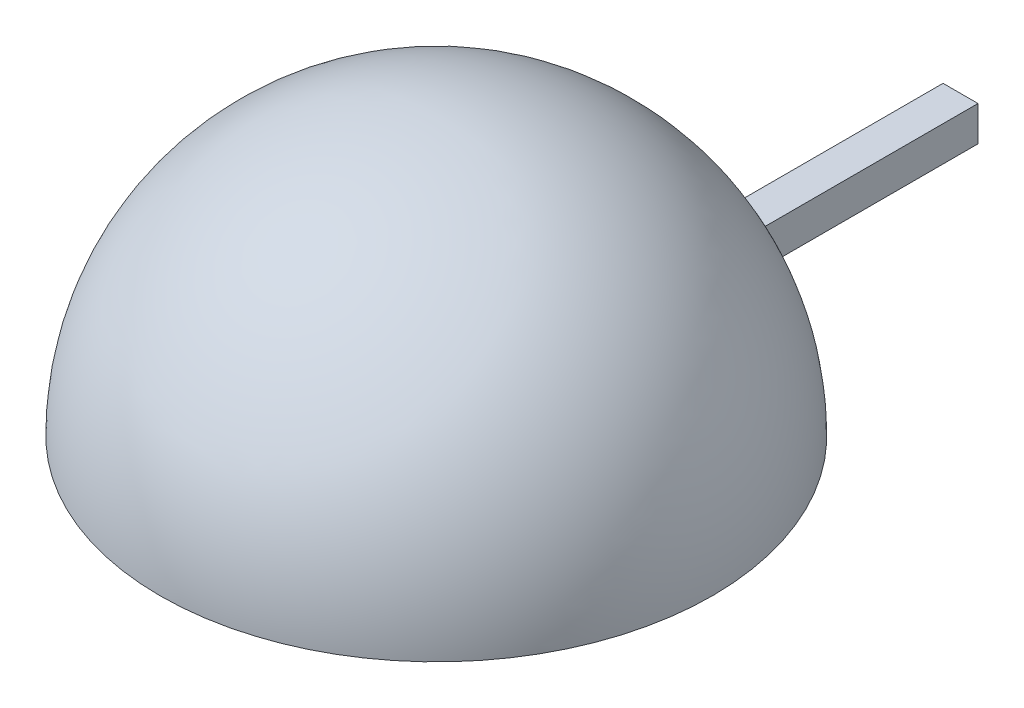
ISO-10303-21;
HEADER;
FILE_DESCRIPTION(('STEP AP214'),'2;1');
FILE_NAME('part.step','',(''),(''),'','','');
FILE_SCHEMA(('AUTOMOTIVE_DESIGN { 1 0 10303 214 1 1 1 1 }'));
ENDSEC;
DATA;
#1=APPLICATION_CONTEXT('core data for automotive mechanical design processes');
#2=APPLICATION_PROTOCOL_DEFINITION('international standard','automotive_design',2000,#1);
#3=PRODUCT_CONTEXT('',#1,'mechanical');
#4=PRODUCT('Part','Part','',(#3));
#5=PRODUCT_RELATED_PRODUCT_CATEGORY('part','',(#4));
#6=PRODUCT_DEFINITION_FORMATION('','',#4);
#7=PRODUCT_DEFINITION_CONTEXT('part definition',#1,'design');
#8=PRODUCT_DEFINITION('design','',#6,#7);
#9=PRODUCT_DEFINITION_SHAPE('','',#8);
#10=(LENGTH_UNIT() NAMED_UNIT(*) SI_UNIT(.MILLI.,.METRE.));
#11=(NAMED_UNIT(*) PLANE_ANGLE_UNIT() SI_UNIT($,.RADIAN.));
#12=(NAMED_UNIT(*) SI_UNIT($,.STERADIAN.) SOLID_ANGLE_UNIT());
#13=UNCERTAINTY_MEASURE_WITH_UNIT(LENGTH_MEASURE(1.E-05),#10,'distance_accuracy_value','');
#14=(GEOMETRIC_REPRESENTATION_CONTEXT(3) GLOBAL_UNCERTAINTY_ASSIGNED_CONTEXT((#13)) GLOBAL_UNIT_ASSIGNED_CONTEXT((#10,
#11,#12)) REPRESENTATION_CONTEXT('',''));
#15=CARTESIAN_POINT('',(0.,0.,0.));
#16=DIRECTION('',(0.,0.,1.));
#17=DIRECTION('',(1.,0.,0.));
#18=AXIS2_PLACEMENT_3D('',#15,#16,#17);
#19=CARTESIAN_POINT('',(0.999999999999999,2.,0.));
#20=DIRECTION('',(-1.,0.,0.));
#21=DIRECTION('',(0.,0.,1.));
#22=AXIS2_PLACEMENT_3D('',#19,#20,#21);
#23=PLANE('',#22);
#24=CARTESIAN_POINT('',(1.00000000000001,0.,15.));
#25=DIRECTION('',(-1.,0.,0.));
#26=DIRECTION('',(0.,0.,1.));
#27=AXIS2_PLACEMENT_3D('',#24,#25,#26);
#28=CIRCLE('',#27,15.7683226755416);
#29=CARTESIAN_POINT('',(0.999999999999999,0.,-0.768322675541617));
#30=VERTEX_POINT('',#29);
#31=CARTESIAN_POINT('',(0.999999999999998,2.,-0.640971836813716));
#32=VERTEX_POINT('',#31);
#33=EDGE_CURVE('E48',#30,#32,#28,.F.);
#34=ORIENTED_EDGE('',*,*,#33,.F.);
#35=DIRECTION('',(0.,0.,-1.));
#36=VECTOR('',#35,1.);
#37=CARTESIAN_POINT('',(0.999999999999999,0.,0.));
#38=LINE('',#37,#36);
#39=CARTESIAN_POINT('',(0.99999999999999,0.,-15.));
#40=VERTEX_POINT('',#39);
#41=EDGE_CURVE('E78',#30,#40,#38,.T.);
#42=ORIENTED_EDGE('',*,*,#41,.T.);
#43=DIRECTION('',(0.,-1.,0.));
#44=VECTOR('',#43,1.);
#45=CARTESIAN_POINT('',(0.99999999999999,2.,-15.));
#46=LINE('',#45,#44);
#47=CARTESIAN_POINT('',(0.99999999999999,2.,-15.));
#48=VERTEX_POINT('',#47);
#49=EDGE_CURVE('E11',#48,#40,#46,.T.);
#50=ORIENTED_EDGE('',*,*,#49,.F.);
#51=DIRECTION('',(0.,0.,-1.));
#52=VECTOR('',#51,1.);
#53=CARTESIAN_POINT('',(0.999999999999999,2.,0.));
#54=LINE('',#53,#52);
#55=EDGE_CURVE('E90',#32,#48,#54,.T.);
#56=ORIENTED_EDGE('',*,*,#55,.F.);
#57=EDGE_LOOP('',(#34,#42,#50,#56));
#58=FACE_BOUND('',#57,.T.);
#59=ADVANCED_FACE('F34',(#58),#23,.F.);
#60=CARTESIAN_POINT('',(-0.999999999999999,2.,0.));
#61=DIRECTION('',(1.,0.,0.));
#62=DIRECTION('',(0.,0.,-1.));
#63=AXIS2_PLACEMENT_3D('',#60,#61,#62);
#64=PLANE('',#63);
#65=CARTESIAN_POINT('',(-0.999999999999999,0.,15.));
#66=DIRECTION('',(1.,0.,0.));
#67=DIRECTION('',(0.,0.,-1.));
#68=AXIS2_PLACEMENT_3D('',#65,#66,#67);
#69=CIRCLE('',#68,15.7683226755416);
#70=CARTESIAN_POINT('',(-0.999999999999999,2.,-0.64097183681372));
#71=VERTEX_POINT('',#70);
#72=CARTESIAN_POINT('',(-0.999999999999999,0.,-0.768322675541617));
#73=VERTEX_POINT('',#72);
#74=EDGE_CURVE('E98',#71,#73,#69,.F.);
#75=ORIENTED_EDGE('',*,*,#74,.F.);
#76=DIRECTION('',(0.,0.,1.));
#77=VECTOR('',#76,1.);
#78=CARTESIAN_POINT('',(-0.999999999999999,2.,0.));
#79=LINE('',#78,#77);
#80=CARTESIAN_POINT('',(-0.999999999999999,2.,-15.));
#81=VERTEX_POINT('',#80);
#82=EDGE_CURVE('E85',#81,#71,#79,.T.);
#83=ORIENTED_EDGE('',*,*,#82,.F.);
#84=DIRECTION('',(0.,-1.,0.));
#85=VECTOR('',#84,1.);
#86=CARTESIAN_POINT('',(-0.999999999999999,2.,-15.));
#87=LINE('',#86,#85);
#88=CARTESIAN_POINT('',(-0.999999999999999,0.,-15.));
#89=VERTEX_POINT('',#88);
#90=EDGE_CURVE('E41',#81,#89,#87,.T.);
#91=ORIENTED_EDGE('',*,*,#90,.T.);
#92=DIRECTION('',(0.,0.,1.));
#93=VECTOR('',#92,1.);
#94=CARTESIAN_POINT('',(-0.999999999999999,0.,0.));
#95=LINE('',#94,#93);
#96=EDGE_CURVE('E77',#89,#73,#95,.T.);
#97=ORIENTED_EDGE('',*,*,#96,.T.);
#98=EDGE_LOOP('',(#75,#83,#91,#97));
#99=FACE_BOUND('',#98,.T.);
#100=ADVANCED_FACE('F83',(#99),#64,.F.);
#101=CARTESIAN_POINT('',(0.99999999999999,2.,-15.));
#102=DIRECTION('',(0.,0.,1.));
#103=DIRECTION('',(1.,0.,0.));
#104=AXIS2_PLACEMENT_3D('',#101,#102,#103);
#105=PLANE('',#104);
#106=DIRECTION('',(-1.,0.,0.));
#107=VECTOR('',#106,1.);
#108=CARTESIAN_POINT('',(0.99999999999999,0.,-15.));
#109=LINE('',#108,#107);
#110=EDGE_CURVE('E69',#40,#89,#109,.T.);
#111=ORIENTED_EDGE('',*,*,#110,.T.);
#112=ORIENTED_EDGE('',*,*,#90,.F.);
#113=DIRECTION('',(-1.,0.,0.));
#114=VECTOR('',#113,1.);
#115=CARTESIAN_POINT('',(0.99999999999999,2.,-15.));
#116=LINE('',#115,#114);
#117=EDGE_CURVE('E57',#48,#81,#116,.T.);
#118=ORIENTED_EDGE('',*,*,#117,.F.);
#119=ORIENTED_EDGE('',*,*,#49,.T.);
#120=EDGE_LOOP('',(#111,#112,#118,#119));
#121=FACE_BOUND('',#120,.T.);
#122=ADVANCED_FACE('F71',(#121),#105,.F.);
#123=CARTESIAN_POINT('',(0.,2.,0.));
#124=DIRECTION('',(0.,1.,0.));
#125=DIRECTION('',(0.,0.,1.));
#126=AXIS2_PLACEMENT_3D('',#123,#124,#125);
#127=PLANE('',#126);
#128=ORIENTED_EDGE('',*,*,#82,.T.);
#129=CARTESIAN_POINT('',(0.,2.,15.));
#130=DIRECTION('',(0.,1.,0.));
#131=DIRECTION('',(0.,0.,1.));
#132=AXIS2_PLACEMENT_3D('',#129,#130,#131);
#133=CIRCLE('',#132,15.6729065587721);
#134=EDGE_CURVE('E101',#71,#32,#133,.F.);
#135=ORIENTED_EDGE('',*,*,#134,.T.);
#136=ORIENTED_EDGE('',*,*,#55,.T.);
#137=ORIENTED_EDGE('',*,*,#117,.T.);
#138=EDGE_LOOP('',(#128,#135,#136,#137));
#139=FACE_BOUND('',#138,.T.);
#140=ADVANCED_FACE('F126',(#139),#127,.T.);
#141=CARTESIAN_POINT('',(0.,0.,0.));
#142=DIRECTION('',(0.,1.,0.));
#143=DIRECTION('',(0.,0.,1.));
#144=AXIS2_PLACEMENT_3D('',#141,#142,#143);
#145=PLANE('',#144);
#146=ORIENTED_EDGE('',*,*,#41,.F.);
#147=CARTESIAN_POINT('',(0.,0.,15.));
#148=DIRECTION('',(0.,-1.,0.));
#149=DIRECTION('',(0.,0.,1.));
#150=AXIS2_PLACEMENT_3D('',#147,#148,#149);
#151=CIRCLE('',#150,15.8);
#152=EDGE_CURVE('E89',#30,#73,#151,.T.);
#153=ORIENTED_EDGE('',*,*,#152,.T.);
#154=ORIENTED_EDGE('',*,*,#96,.F.);
#155=ORIENTED_EDGE('',*,*,#110,.F.);
#156=EDGE_LOOP('',(#146,#153,#154,#155));
#157=FACE_BOUND('',#156,.T.);
#158=CARTESIAN_POINT('',(0.,0.,15.));
#159=DIRECTION('',(0.,1.,0.));
#160=DIRECTION('',(0.,0.,1.));
#161=AXIS2_PLACEMENT_3D('',#158,#159,#160);
#162=CIRCLE('',#161,15.);
#163=CARTESIAN_POINT('',(0.,0.,30.));
#164=VERTEX_POINT('',#163);
#165=EDGE_CURVE('E104',#164,#164,#162,.T.);
#166=ORIENTED_EDGE('',*,*,#165,.T.);
#167=EDGE_LOOP('',(#166));
#168=FACE_BOUND('',#167,.T.);
#169=ADVANCED_FACE('F87',(#157,#168),#145,.F.);
#170=CARTESIAN_POINT('',(0.,0.,15.));
#171=DIRECTION('',(0.,0.,1.));
#172=DIRECTION('',(1.,0.,0.));
#173=AXIS2_PLACEMENT_3D('',#170,#171,#172);
#174=SPHERICAL_SURFACE('',#173,15.8);
#175=ORIENTED_EDGE('',*,*,#152,.F.);
#176=ORIENTED_EDGE('',*,*,#33,.T.);
#177=ORIENTED_EDGE('',*,*,#134,.F.);
#178=ORIENTED_EDGE('',*,*,#74,.T.);
#179=EDGE_LOOP('',(#175,#176,#177,#178));
#180=FACE_BOUND('',#179,.T.);
#181=ADVANCED_FACE('F110',(#180),#174,.T.);
#182=CARTESIAN_POINT('',(0.,0.,15.));
#183=DIRECTION('',(0.,0.,1.));
#184=DIRECTION('',(-1.,0.,0.));
#185=AXIS2_PLACEMENT_3D('',#182,#183,#184);
#186=SPHERICAL_SURFACE('',#185,15.);
#187=CARTESIAN_POINT('',(0.,0.,15.));
#188=DIRECTION('',(0.,1.,0.));
#189=DIRECTION('',(0.,0.,1.));
#190=AXIS2_PLACEMENT_3D('',#187,#188,#189);
#191=SPHERICAL_SURFACE('',#190,15.);
#192=ORIENTED_EDGE('',*,*,#165,.F.);
#193=EDGE_LOOP('',(#192));
#194=FACE_BOUND('',#193,.T.);
#195=ADVANCED_FACE('F108',(#194),#191,.F.);
#196=CLOSED_SHELL('',(#59,#100,#122,#140,#169,#181,#195));
#197=MANIFOLD_SOLID_BREP('B2',#196);
#198=ADVANCED_BREP_SHAPE_REPRESENTATION('',(#18,#197),#14);
#199=SHAPE_DEFINITION_REPRESENTATION(#9,#198);
ENDSEC;
END-ISO-10303-21;
